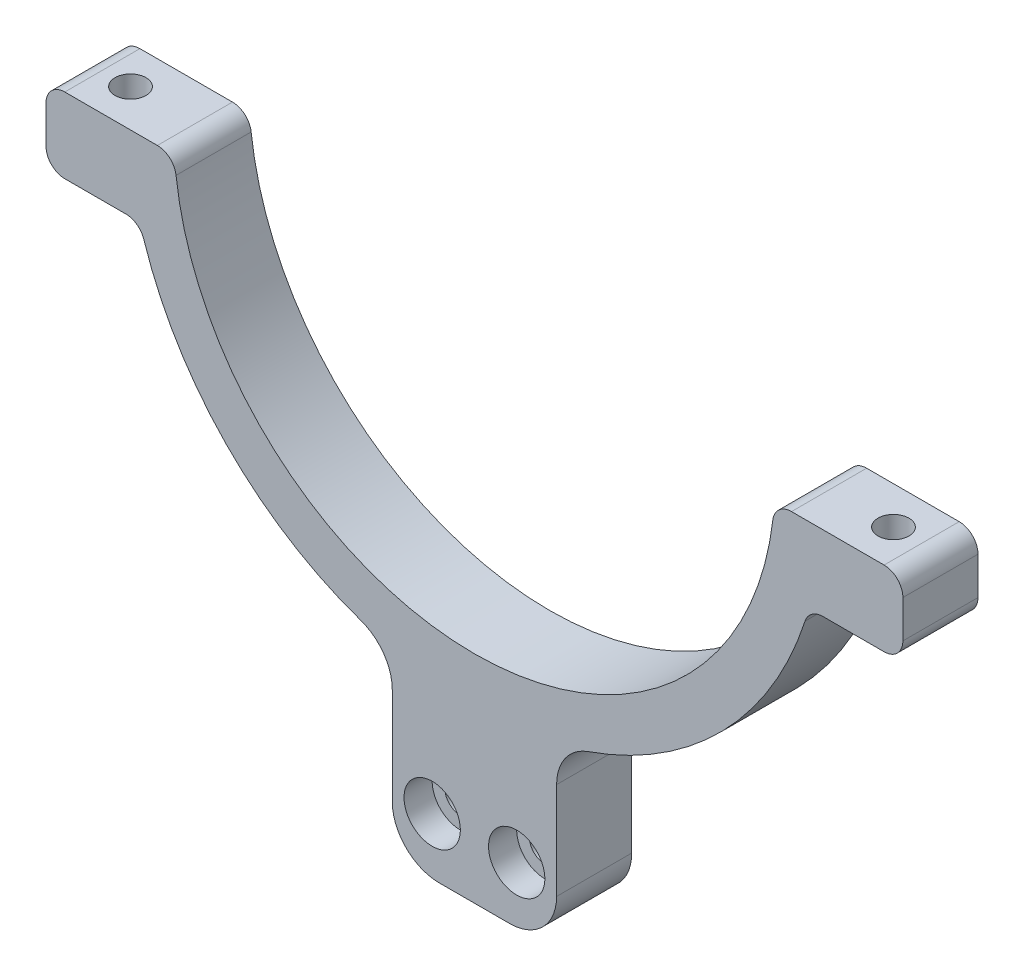
ISO-10303-21;
HEADER;
FILE_DESCRIPTION(('STEP AP214'),'2;1');
FILE_NAME('part.step','',(''),(''),'','','');
FILE_SCHEMA(('AUTOMOTIVE_DESIGN { 1 0 10303 214 1 1 1 1 }'));
ENDSEC;
DATA;
#1=APPLICATION_CONTEXT('core data for automotive mechanical design processes');
#2=APPLICATION_PROTOCOL_DEFINITION('international standard','automotive_design',2000,#1);
#3=PRODUCT_CONTEXT('',#1,'mechanical');
#4=PRODUCT('Part','Part','',(#3));
#5=PRODUCT_RELATED_PRODUCT_CATEGORY('part','',(#4));
#6=PRODUCT_DEFINITION_FORMATION('','',#4);
#7=PRODUCT_DEFINITION_CONTEXT('part definition',#1,'design');
#8=PRODUCT_DEFINITION('design','',#6,#7);
#9=PRODUCT_DEFINITION_SHAPE('','',#8);
#10=(LENGTH_UNIT() NAMED_UNIT(*) SI_UNIT(.MILLI.,.METRE.));
#11=(NAMED_UNIT(*) PLANE_ANGLE_UNIT() SI_UNIT($,.RADIAN.));
#12=(NAMED_UNIT(*) SI_UNIT($,.STERADIAN.) SOLID_ANGLE_UNIT());
#13=UNCERTAINTY_MEASURE_WITH_UNIT(LENGTH_MEASURE(1.E-05),#10,'distance_accuracy_value','');
#14=(GEOMETRIC_REPRESENTATION_CONTEXT(3) GLOBAL_UNCERTAINTY_ASSIGNED_CONTEXT((#13)) GLOBAL_UNIT_ASSIGNED_CONTEXT((#10,
#11,#12)) REPRESENTATION_CONTEXT('',''));
#15=CARTESIAN_POINT('',(0.,0.,0.));
#16=DIRECTION('',(0.,0.,1.));
#17=DIRECTION('',(1.,0.,0.));
#18=AXIS2_PLACEMENT_3D('',#15,#16,#17);
#19=CARTESIAN_POINT('',(-4.5,-49.,0.));
#20=DIRECTION('',(0.,0.,1.));
#21=DIRECTION('',(1.,0.,0.));
#22=AXIS2_PLACEMENT_3D('',#19,#20,#21);
#23=CYLINDRICAL_SURFACE('',#22,1.65);
#24=CARTESIAN_POINT('',(-4.5,-49.,0.));
#25=DIRECTION('',(0.,0.,1.));
#26=DIRECTION('',(1.,0.,0.));
#27=AXIS2_PLACEMENT_3D('',#24,#25,#26);
#28=CIRCLE('',#27,1.65);
#29=CARTESIAN_POINT('',(-2.85,-49.,0.));
#30=VERTEX_POINT('',#29);
#31=EDGE_CURVE('E402',#30,#30,#28,.T.);
#32=ORIENTED_EDGE('',*,*,#31,.F.);
#33=EDGE_LOOP('',(#32));
#34=FACE_BOUND('',#33,.T.);
#35=CARTESIAN_POINT('',(-4.5,-49.,5.));
#36=DIRECTION('',(0.,0.,1.));
#37=DIRECTION('',(1.,0.,0.));
#38=AXIS2_PLACEMENT_3D('',#35,#36,#37);
#39=CIRCLE('',#38,1.65);
#40=CARTESIAN_POINT('',(-2.85,-49.,5.));
#41=VERTEX_POINT('',#40);
#42=EDGE_CURVE('E52',#41,#41,#39,.F.);
#43=ORIENTED_EDGE('',*,*,#42,.F.);
#44=EDGE_LOOP('',(#43));
#45=FACE_BOUND('',#44,.T.);
#46=ADVANCED_FACE('F48',(#34,#45),#23,.F.);
#47=CARTESIAN_POINT('',(4.5,-49.,0.));
#48=DIRECTION('',(0.,0.,1.));
#49=DIRECTION('',(1.,0.,0.));
#50=AXIS2_PLACEMENT_3D('',#47,#48,#49);
#51=CYLINDRICAL_SURFACE('',#50,1.65);
#52=CARTESIAN_POINT('',(4.5,-49.,0.));
#53=DIRECTION('',(0.,0.,1.));
#54=DIRECTION('',(1.,0.,0.));
#55=AXIS2_PLACEMENT_3D('',#52,#53,#54);
#56=CIRCLE('',#55,1.65);
#57=CARTESIAN_POINT('',(6.15,-49.,0.));
#58=VERTEX_POINT('',#57);
#59=EDGE_CURVE('E409',#58,#58,#56,.T.);
#60=ORIENTED_EDGE('',*,*,#59,.F.);
#61=EDGE_LOOP('',(#60));
#62=FACE_BOUND('',#61,.T.);
#63=CARTESIAN_POINT('',(4.5,-49.,5.));
#64=DIRECTION('',(0.,0.,1.));
#65=DIRECTION('',(1.,0.,0.));
#66=AXIS2_PLACEMENT_3D('',#63,#64,#65);
#67=CIRCLE('',#66,1.65);
#68=CARTESIAN_POINT('',(6.15,-49.,5.));
#69=VERTEX_POINT('',#68);
#70=EDGE_CURVE('E379',#69,#69,#67,.F.);
#71=ORIENTED_EDGE('',*,*,#70,.F.);
#72=EDGE_LOOP('',(#71));
#73=FACE_BOUND('',#72,.T.);
#74=ADVANCED_FACE('F492',(#62,#73),#51,.F.);
#75=CARTESIAN_POINT('',(-40.6230262611138,-1.99999999999997,4.));
#76=DIRECTION('',(0.,-1.,0.));
#77=DIRECTION('',(1.,0.,0.));
#78=AXIS2_PLACEMENT_3D('',#75,#76,#77);
#79=CYLINDRICAL_SURFACE('',#78,1.65);
#80=CARTESIAN_POINT('',(-40.6230262611138,-1.99999999999997,4.));
#81=DIRECTION('',(0.,1.,0.));
#82=DIRECTION('',(-1.,0.,0.));
#83=AXIS2_PLACEMENT_3D('',#80,#81,#82);
#84=CIRCLE('',#83,1.65);
#85=CARTESIAN_POINT('',(-42.2730262611137,-1.99999999999997,4.));
#86=VERTEX_POINT('',#85);
#87=EDGE_CURVE('E278',#86,#86,#84,.T.);
#88=ORIENTED_EDGE('',*,*,#87,.T.);
#89=EDGE_LOOP('',(#88));
#90=FACE_BOUND('',#89,.T.);
#91=CARTESIAN_POINT('',(-40.6230262611138,-7.,4.));
#92=DIRECTION('',(0.,-1.,0.));
#93=DIRECTION('',(1.,0.,0.));
#94=AXIS2_PLACEMENT_3D('',#91,#92,#93);
#95=CIRCLE('',#94,1.65);
#96=CARTESIAN_POINT('',(-38.9730262611138,-7.,4.));
#97=VERTEX_POINT('',#96);
#98=EDGE_CURVE('E276',#97,#97,#95,.T.);
#99=ORIENTED_EDGE('',*,*,#98,.T.);
#100=EDGE_LOOP('',(#99));
#101=FACE_BOUND('',#100,.T.);
#102=ADVANCED_FACE('F498',(#90,#101),#79,.F.);
#103=CARTESIAN_POINT('',(40.6230262611138,-1.99999999999998,4.));
#104=DIRECTION('',(0.,-1.,0.));
#105=DIRECTION('',(1.,0.,0.));
#106=AXIS2_PLACEMENT_3D('',#103,#104,#105);
#107=CYLINDRICAL_SURFACE('',#106,1.65);
#108=CARTESIAN_POINT('',(40.6230262611138,-1.99999999999998,4.));
#109=DIRECTION('',(0.,-1.,0.));
#110=DIRECTION('',(1.,0.,0.));
#111=AXIS2_PLACEMENT_3D('',#108,#109,#110);
#112=CIRCLE('',#111,1.65);
#113=CARTESIAN_POINT('',(42.2730262611137,-1.99999999999998,4.));
#114=VERTEX_POINT('',#113);
#115=EDGE_CURVE('E274',#114,#114,#112,.T.);
#116=ORIENTED_EDGE('',*,*,#115,.F.);
#117=EDGE_LOOP('',(#116));
#118=FACE_BOUND('',#117,.T.);
#119=CARTESIAN_POINT('',(40.6230262611138,-7.,4.));
#120=DIRECTION('',(0.,-1.,0.));
#121=DIRECTION('',(1.,0.,0.));
#122=AXIS2_PLACEMENT_3D('',#119,#120,#121);
#123=CIRCLE('',#122,1.65);
#124=CARTESIAN_POINT('',(42.2730262611137,-7.,4.));
#125=VERTEX_POINT('',#124);
#126=EDGE_CURVE('E271',#125,#125,#123,.F.);
#127=ORIENTED_EDGE('',*,*,#126,.F.);
#128=EDGE_LOOP('',(#127));
#129=FACE_BOUND('',#128,.T.);
#130=ADVANCED_FACE('F604',(#118,#129),#107,.F.);
#131=CARTESIAN_POINT('',(0.,0.,8.));
#132=DIRECTION('',(0.,0.,-1.));
#133=DIRECTION('',(-1.,0.,0.));
#134=AXIS2_PLACEMENT_3D('',#131,#132,#133);
#135=PLANE('',#134);
#136=CARTESIAN_POINT('',(4.5,-49.,8.));
#137=DIRECTION('',(0.,0.,1.));
#138=DIRECTION('',(1.,0.,0.));
#139=AXIS2_PLACEMENT_3D('',#136,#137,#138);
#140=CIRCLE('',#139,3.);
#141=CARTESIAN_POINT('',(7.5,-49.,8.));
#142=VERTEX_POINT('',#141);
#143=EDGE_CURVE('E387',#142,#142,#140,.T.);
#144=ORIENTED_EDGE('',*,*,#143,.F.);
#145=EDGE_LOOP('',(#144));
#146=FACE_BOUND('',#145,.T.);
#147=CARTESIAN_POINT('',(-4.5,-49.,8.));
#148=DIRECTION('',(0.,0.,1.));
#149=DIRECTION('',(1.,0.,0.));
#150=AXIS2_PLACEMENT_3D('',#147,#148,#149);
#151=CIRCLE('',#150,3.);
#152=CARTESIAN_POINT('',(-1.5,-49.,8.));
#153=VERTEX_POINT('',#152);
#154=EDGE_CURVE('E392',#153,#153,#151,.T.);
#155=ORIENTED_EDGE('',*,*,#154,.F.);
#156=EDGE_LOOP('',(#155));
#157=FACE_BOUND('',#156,.T.);
#158=DIRECTION('',(0.,1.,0.));
#159=VECTOR('',#158,1.);
#160=CARTESIAN_POINT('',(-8.75,-55.,8.));
#161=LINE('',#160,#159);
#162=CARTESIAN_POINT('',(-8.75,-50.,8.));
#163=VERTEX_POINT('',#162);
#164=CARTESIAN_POINT('',(-8.75,-39.6854822321715,8.));
#165=VERTEX_POINT('',#164);
#166=EDGE_CURVE('E403',#163,#165,#161,.T.);
#167=ORIENTED_EDGE('',*,*,#166,.F.);
#168=CARTESIAN_POINT('',(-3.75,-50.,8.));
#169=DIRECTION('',(0.,0.,-1.));
#170=DIRECTION('',(-1.,0.,0.));
#171=AXIS2_PLACEMENT_3D('',#168,#169,#170);
#172=CIRCLE('',#171,5.);
#173=CARTESIAN_POINT('',(-3.75,-55.,8.));
#174=VERTEX_POINT('',#173);
#175=EDGE_CURVE('E357',#163,#174,#172,.F.);
#176=ORIENTED_EDGE('',*,*,#175,.T.);
#177=DIRECTION('',(-1.,0.,0.));
#178=VECTOR('',#177,1.);
#179=CARTESIAN_POINT('',(-11.,-55.,8.));
#180=LINE('',#179,#178);
#181=CARTESIAN_POINT('',(3.75,-55.,8.));
#182=VERTEX_POINT('',#181);
#183=EDGE_CURVE('E412',#182,#174,#180,.T.);
#184=ORIENTED_EDGE('',*,*,#183,.F.);
#185=CARTESIAN_POINT('',(3.75,-50.,8.));
#186=DIRECTION('',(0.,0.,-1.));
#187=DIRECTION('',(-1.,0.,0.));
#188=AXIS2_PLACEMENT_3D('',#185,#186,#187);
#189=CIRCLE('',#188,5.);
#190=CARTESIAN_POINT('',(8.75,-50.,8.));
#191=VERTEX_POINT('',#190);
#192=EDGE_CURVE('E355',#182,#191,#189,.F.);
#193=ORIENTED_EDGE('',*,*,#192,.T.);
#194=DIRECTION('',(0.,-1.,0.));
#195=VECTOR('',#194,1.);
#196=CARTESIAN_POINT('',(8.75,-55.,8.));
#197=LINE('',#196,#195);
#198=CARTESIAN_POINT('',(8.75,-39.6854822321715,8.));
#199=VERTEX_POINT('',#198);
#200=EDGE_CURVE('E406',#199,#191,#197,.T.);
#201=ORIENTED_EDGE('',*,*,#200,.F.);
#202=CARTESIAN_POINT('',(13.75,-39.6854822321715,8.));
#203=DIRECTION('',(0.,0.,-1.));
#204=DIRECTION('',(-1.,0.,0.));
#205=AXIS2_PLACEMENT_3D('',#202,#203,#204);
#206=CIRCLE('',#205,5.);
#207=CARTESIAN_POINT('',(12.1130952380952,-34.9610200616749,8.));
#208=VERTEX_POINT('',#207);
#209=EDGE_CURVE('E376',#199,#208,#206,.T.);
#210=ORIENTED_EDGE('',*,*,#209,.T.);
#211=CARTESIAN_POINT('',(0.,0.,8.));
#212=DIRECTION('',(0.,0.,1.));
#213=DIRECTION('',(1.,0.,0.));
#214=AXIS2_PLACEMENT_3D('',#211,#212,#213);
#215=CIRCLE('',#214,37.);
#216=CARTESIAN_POINT('',(35.2049788033508,-11.3846153846154,8.));
#217=VERTEX_POINT('',#216);
#218=EDGE_CURVE('E439',#208,#217,#215,.T.);
#219=ORIENTED_EDGE('',*,*,#218,.T.);
#220=CARTESIAN_POINT('',(37.1079506305589,-12.,8.));
#221=DIRECTION('',(0.,0.,-1.));
#222=DIRECTION('',(-1.,0.,0.));
#223=AXIS2_PLACEMENT_3D('',#220,#221,#222);
#224=CIRCLE('',#223,2.);
#225=CARTESIAN_POINT('',(37.1079506305589,-10.,8.));
#226=VERTEX_POINT('',#225);
#227=EDGE_CURVE('E348',#217,#226,#224,.T.);
#228=ORIENTED_EDGE('',*,*,#227,.T.);
#229=DIRECTION('',(1.,0.,0.));
#230=VECTOR('',#229,1.);
#231=CARTESIAN_POINT('',(35.6230262611138,-10.,8.));
#232=LINE('',#231,#230);
#233=CARTESIAN_POINT('',(43.6230262611138,-10.,8.));
#234=VERTEX_POINT('',#233);
#235=EDGE_CURVE('E441',#226,#234,#232,.T.);
#236=ORIENTED_EDGE('',*,*,#235,.T.);
#237=CARTESIAN_POINT('',(43.6230262611138,-8.,8.));
#238=DIRECTION('',(0.,0.,-1.));
#239=DIRECTION('',(-1.,0.,0.));
#240=AXIS2_PLACEMENT_3D('',#237,#238,#239);
#241=CIRCLE('',#240,2.);
#242=CARTESIAN_POINT('',(45.6230262611138,-8.,8.));
#243=VERTEX_POINT('',#242);
#244=EDGE_CURVE('E310',#234,#243,#241,.F.);
#245=ORIENTED_EDGE('',*,*,#244,.T.);
#246=DIRECTION('',(0.,1.,0.));
#247=VECTOR('',#246,1.);
#248=CARTESIAN_POINT('',(45.6230262611138,-10.,8.));
#249=LINE('',#248,#247);
#250=CARTESIAN_POINT('',(45.6230262611138,-4.,8.));
#251=VERTEX_POINT('',#250);
#252=EDGE_CURVE('E444',#243,#251,#249,.T.);
#253=ORIENTED_EDGE('',*,*,#252,.T.);
#254=CARTESIAN_POINT('',(43.6230262611138,-4.,8.));
#255=DIRECTION('',(0.,0.,-1.));
#256=DIRECTION('',(-1.,0.,0.));
#257=AXIS2_PLACEMENT_3D('',#254,#255,#256);
#258=CIRCLE('',#257,2.);
#259=CARTESIAN_POINT('',(43.6230262611138,-2.,8.));
#260=VERTEX_POINT('',#259);
#261=EDGE_CURVE('E312',#251,#260,#258,.F.);
#262=ORIENTED_EDGE('',*,*,#261,.T.);
#263=DIRECTION('',(-1.,0.,0.));
#264=VECTOR('',#263,1.);
#265=CARTESIAN_POINT('',(31.9374388453426,-2.,8.));
#266=LINE('',#265,#264);
#267=CARTESIAN_POINT('',(33.7638860322683,-2.,8.));
#268=VERTEX_POINT('',#267);
#269=EDGE_CURVE('E447',#260,#268,#266,.T.);
#270=ORIENTED_EDGE('',*,*,#269,.T.);
#271=CARTESIAN_POINT('',(33.7638860322683,-4.,8.));
#272=DIRECTION('',(0.,0.,-1.));
#273=DIRECTION('',(-1.,0.,0.));
#274=AXIS2_PLACEMENT_3D('',#271,#272,#273);
#275=CIRCLE('',#274,2.);
#276=CARTESIAN_POINT('',(31.7777750891937,-3.76470588235294,8.));
#277=VERTEX_POINT('',#276);
#278=EDGE_CURVE('E314',#268,#277,#275,.F.);
#279=ORIENTED_EDGE('',*,*,#278,.T.);
#280=CARTESIAN_POINT('',(0.,0.,8.));
#281=DIRECTION('',(0.,0.,-1.));
#282=DIRECTION('',(-1.,0.,0.));
#283=AXIS2_PLACEMENT_3D('',#280,#281,#282);
#284=CIRCLE('',#283,32.);
#285=CARTESIAN_POINT('',(-31.7777750891937,-3.76470588235294,8.));
#286=VERTEX_POINT('',#285);
#287=EDGE_CURVE('E450',#277,#286,#284,.T.);
#288=ORIENTED_EDGE('',*,*,#287,.T.);
#289=CARTESIAN_POINT('',(-33.7638860322683,-4.,8.));
#290=DIRECTION('',(0.,0.,-1.));
#291=DIRECTION('',(-1.,0.,0.));
#292=AXIS2_PLACEMENT_3D('',#289,#290,#291);
#293=CIRCLE('',#292,2.);
#294=CARTESIAN_POINT('',(-33.7638860322683,-2.,8.));
#295=VERTEX_POINT('',#294);
#296=EDGE_CURVE('E316',#286,#295,#293,.F.);
#297=ORIENTED_EDGE('',*,*,#296,.T.);
#298=DIRECTION('',(-1.,0.,0.));
#299=VECTOR('',#298,1.);
#300=CARTESIAN_POINT('',(-31.9374388453426,-2.,8.));
#301=LINE('',#300,#299);
#302=CARTESIAN_POINT('',(-43.6230262611138,-2.,8.));
#303=VERTEX_POINT('',#302);
#304=EDGE_CURVE('E240',#295,#303,#301,.T.);
#305=ORIENTED_EDGE('',*,*,#304,.T.);
#306=CARTESIAN_POINT('',(-43.6230262611138,-4.,8.));
#307=DIRECTION('',(0.,0.,-1.));
#308=DIRECTION('',(-1.,0.,0.));
#309=AXIS2_PLACEMENT_3D('',#306,#307,#308);
#310=CIRCLE('',#309,2.);
#311=CARTESIAN_POINT('',(-45.6230262611138,-4.,8.));
#312=VERTEX_POINT('',#311);
#313=EDGE_CURVE('E318',#303,#312,#310,.F.);
#314=ORIENTED_EDGE('',*,*,#313,.T.);
#315=DIRECTION('',(0.,-1.,0.));
#316=VECTOR('',#315,1.);
#317=CARTESIAN_POINT('',(-45.6230262611138,-10.,8.));
#318=LINE('',#317,#316);
#319=CARTESIAN_POINT('',(-45.6230262611138,-8.,8.));
#320=VERTEX_POINT('',#319);
#321=EDGE_CURVE('E270',#312,#320,#318,.T.);
#322=ORIENTED_EDGE('',*,*,#321,.T.);
#323=CARTESIAN_POINT('',(-43.6230262611138,-8.,8.));
#324=DIRECTION('',(0.,0.,-1.));
#325=DIRECTION('',(-1.,0.,0.));
#326=AXIS2_PLACEMENT_3D('',#323,#324,#325);
#327=CIRCLE('',#326,2.);
#328=CARTESIAN_POINT('',(-43.6230262611138,-10.,8.));
#329=VERTEX_POINT('',#328);
#330=EDGE_CURVE('E308',#320,#329,#327,.F.);
#331=ORIENTED_EDGE('',*,*,#330,.T.);
#332=DIRECTION('',(1.,0.,0.));
#333=VECTOR('',#332,1.);
#334=CARTESIAN_POINT('',(-35.6230262611138,-10.,8.));
#335=LINE('',#334,#333);
#336=CARTESIAN_POINT('',(-37.1079506305589,-10.,8.));
#337=VERTEX_POINT('',#336);
#338=EDGE_CURVE('E435',#329,#337,#335,.T.);
#339=ORIENTED_EDGE('',*,*,#338,.T.);
#340=CARTESIAN_POINT('',(-37.1079506305589,-12.,8.));
#341=DIRECTION('',(0.,0.,-1.));
#342=DIRECTION('',(-1.,0.,0.));
#343=AXIS2_PLACEMENT_3D('',#340,#341,#342);
#344=CIRCLE('',#343,2.);
#345=CARTESIAN_POINT('',(-35.2049788033508,-11.3846153846154,8.));
#346=VERTEX_POINT('',#345);
#347=EDGE_CURVE('E227',#337,#346,#344,.T.);
#348=ORIENTED_EDGE('',*,*,#347,.T.);
#349=CARTESIAN_POINT('',(0.,0.,8.));
#350=DIRECTION('',(0.,0.,1.));
#351=DIRECTION('',(-1.,0.,0.));
#352=AXIS2_PLACEMENT_3D('',#349,#350,#351);
#353=CIRCLE('',#352,37.);
#354=CARTESIAN_POINT('',(-12.1130952380952,-34.9610200616749,8.));
#355=VERTEX_POINT('',#354);
#356=EDGE_CURVE('E238',#346,#355,#353,.T.);
#357=ORIENTED_EDGE('',*,*,#356,.T.);
#358=CARTESIAN_POINT('',(-13.75,-39.6854822321715,8.));
#359=DIRECTION('',(0.,0.,-1.));
#360=DIRECTION('',(-1.,0.,0.));
#361=AXIS2_PLACEMENT_3D('',#358,#359,#360);
#362=CIRCLE('',#361,5.);
#363=EDGE_CURVE('E57',#355,#165,#362,.T.);
#364=ORIENTED_EDGE('',*,*,#363,.T.);
#365=EDGE_LOOP('',(#167,#176,#184,#193,#201,#210,#219,#228,#236,#245,#253,#262,#270,#279,#288,
#297,#305,#314,#322,#331,#339,#348,#357,#364));
#366=FACE_BOUND('',#365,.T.);
#367=ADVANCED_FACE('F469',(#146,#157,#366),#135,.F.);
#368=CARTESIAN_POINT('',(0.,0.,0.));
#369=DIRECTION('',(0.,0.,-1.));
#370=DIRECTION('',(-1.,0.,0.));
#371=AXIS2_PLACEMENT_3D('',#368,#369,#370);
#372=PLANE('',#371);
#373=DIRECTION('',(-1.,0.,0.));
#374=VECTOR('',#373,1.);
#375=CARTESIAN_POINT('',(-11.,-55.,0.));
#376=LINE('',#375,#374);
#377=CARTESIAN_POINT('',(3.75,-55.,0.));
#378=VERTEX_POINT('',#377);
#379=CARTESIAN_POINT('',(-3.75,-55.,0.));
#380=VERTEX_POINT('',#379);
#381=EDGE_CURVE('E415',#378,#380,#376,.T.);
#382=ORIENTED_EDGE('',*,*,#381,.T.);
#383=CARTESIAN_POINT('',(-3.75,-50.,0.));
#384=DIRECTION('',(0.,0.,-1.));
#385=DIRECTION('',(-1.,0.,0.));
#386=AXIS2_PLACEMENT_3D('',#383,#384,#385);
#387=CIRCLE('',#386,5.);
#388=CARTESIAN_POINT('',(-8.75,-50.,0.));
#389=VERTEX_POINT('',#388);
#390=EDGE_CURVE('E366',#380,#389,#387,.T.);
#391=ORIENTED_EDGE('',*,*,#390,.T.);
#392=DIRECTION('',(0.,1.,0.));
#393=VECTOR('',#392,1.);
#394=CARTESIAN_POINT('',(-8.75,-55.,0.));
#395=LINE('',#394,#393);
#396=CARTESIAN_POINT('',(-8.75,-39.6854822321715,0.));
#397=VERTEX_POINT('',#396);
#398=EDGE_CURVE('E400',#389,#397,#395,.T.);
#399=ORIENTED_EDGE('',*,*,#398,.T.);
#400=CARTESIAN_POINT('',(-13.75,-39.6854822321715,0.));
#401=DIRECTION('',(0.,0.,-1.));
#402=DIRECTION('',(-1.,0.,0.));
#403=AXIS2_PLACEMENT_3D('',#400,#401,#402);
#404=CIRCLE('',#403,5.);
#405=CARTESIAN_POINT('',(-12.1130952380952,-34.9610200616749,0.));
#406=VERTEX_POINT('',#405);
#407=EDGE_CURVE('E12',#397,#406,#404,.F.);
#408=ORIENTED_EDGE('',*,*,#407,.T.);
#409=CARTESIAN_POINT('',(0.,0.,0.));
#410=DIRECTION('',(0.,0.,1.));
#411=DIRECTION('',(-1.,0.,0.));
#412=AXIS2_PLACEMENT_3D('',#409,#410,#411);
#413=CIRCLE('',#412,37.);
#414=CARTESIAN_POINT('',(-35.2049788033508,-11.3846153846154,0.));
#415=VERTEX_POINT('',#414);
#416=EDGE_CURVE('E235',#415,#406,#413,.T.);
#417=ORIENTED_EDGE('',*,*,#416,.F.);
#418=CARTESIAN_POINT('',(-37.1079506305589,-12.,0.));
#419=DIRECTION('',(0.,0.,-1.));
#420=DIRECTION('',(-1.,0.,0.));
#421=AXIS2_PLACEMENT_3D('',#418,#419,#420);
#422=CIRCLE('',#421,2.);
#423=CARTESIAN_POINT('',(-37.1079506305589,-10.,0.));
#424=VERTEX_POINT('',#423);
#425=EDGE_CURVE('E218',#415,#424,#422,.F.);
#426=ORIENTED_EDGE('',*,*,#425,.T.);
#427=DIRECTION('',(1.,0.,0.));
#428=VECTOR('',#427,1.);
#429=CARTESIAN_POINT('',(-35.6230262611138,-10.,0.));
#430=LINE('',#429,#428);
#431=CARTESIAN_POINT('',(-43.6230262611138,-10.,0.));
#432=VERTEX_POINT('',#431);
#433=EDGE_CURVE('E248',#432,#424,#430,.T.);
#434=ORIENTED_EDGE('',*,*,#433,.F.);
#435=CARTESIAN_POINT('',(-43.6230262611138,-8.,0.));
#436=DIRECTION('',(0.,0.,-1.));
#437=DIRECTION('',(-1.,0.,0.));
#438=AXIS2_PLACEMENT_3D('',#435,#436,#437);
#439=CIRCLE('',#438,2.);
#440=CARTESIAN_POINT('',(-45.6230262611138,-8.,0.));
#441=VERTEX_POINT('',#440);
#442=EDGE_CURVE('E291',#432,#441,#439,.T.);
#443=ORIENTED_EDGE('',*,*,#442,.T.);
#444=DIRECTION('',(0.,-1.,0.));
#445=VECTOR('',#444,1.);
#446=CARTESIAN_POINT('',(-45.6230262611138,-10.,0.));
#447=LINE('',#446,#445);
#448=CARTESIAN_POINT('',(-45.6230262611138,-4.,0.));
#449=VERTEX_POINT('',#448);
#450=EDGE_CURVE('E252',#449,#441,#447,.T.);
#451=ORIENTED_EDGE('',*,*,#450,.F.);
#452=CARTESIAN_POINT('',(-43.6230262611138,-4.,0.));
#453=DIRECTION('',(0.,0.,-1.));
#454=DIRECTION('',(-1.,0.,0.));
#455=AXIS2_PLACEMENT_3D('',#452,#453,#454);
#456=CIRCLE('',#455,2.);
#457=CARTESIAN_POINT('',(-43.6230262611138,-2.,0.));
#458=VERTEX_POINT('',#457);
#459=EDGE_CURVE('E301',#449,#458,#456,.T.);
#460=ORIENTED_EDGE('',*,*,#459,.T.);
#461=DIRECTION('',(-1.,0.,0.));
#462=VECTOR('',#461,1.);
#463=CARTESIAN_POINT('',(-31.9374388453426,-2.,0.));
#464=LINE('',#463,#462);
#465=CARTESIAN_POINT('',(-33.7638860322683,-2.,0.));
#466=VERTEX_POINT('',#465);
#467=EDGE_CURVE('E267',#466,#458,#464,.T.);
#468=ORIENTED_EDGE('',*,*,#467,.F.);
#469=CARTESIAN_POINT('',(-33.7638860322683,-4.,0.));
#470=DIRECTION('',(0.,0.,-1.));
#471=DIRECTION('',(-1.,0.,0.));
#472=AXIS2_PLACEMENT_3D('',#469,#470,#471);
#473=CIRCLE('',#472,2.);
#474=CARTESIAN_POINT('',(-31.7777750891937,-3.76470588235294,0.));
#475=VERTEX_POINT('',#474);
#476=EDGE_CURVE('E299',#466,#475,#473,.T.);
#477=ORIENTED_EDGE('',*,*,#476,.T.);
#478=CARTESIAN_POINT('',(0.,0.,0.));
#479=DIRECTION('',(0.,0.,-1.));
#480=DIRECTION('',(-1.,0.,0.));
#481=AXIS2_PLACEMENT_3D('',#478,#479,#480);
#482=CIRCLE('',#481,32.);
#483=CARTESIAN_POINT('',(31.7777750891937,-3.76470588235294,0.));
#484=VERTEX_POINT('',#483);
#485=EDGE_CURVE('E264',#484,#475,#482,.T.);
#486=ORIENTED_EDGE('',*,*,#485,.F.);
#487=CARTESIAN_POINT('',(33.7638860322683,-4.,0.));
#488=DIRECTION('',(0.,0.,-1.));
#489=DIRECTION('',(-1.,0.,0.));
#490=AXIS2_PLACEMENT_3D('',#487,#488,#489);
#491=CIRCLE('',#490,2.);
#492=CARTESIAN_POINT('',(33.7638860322683,-2.,0.));
#493=VERTEX_POINT('',#492);
#494=EDGE_CURVE('E297',#484,#493,#491,.T.);
#495=ORIENTED_EDGE('',*,*,#494,.T.);
#496=DIRECTION('',(-1.,0.,0.));
#497=VECTOR('',#496,1.);
#498=CARTESIAN_POINT('',(31.9374388453426,-2.,0.));
#499=LINE('',#498,#497);
#500=CARTESIAN_POINT('',(43.6230262611138,-2.,0.));
#501=VERTEX_POINT('',#500);
#502=EDGE_CURVE('E261',#501,#493,#499,.T.);
#503=ORIENTED_EDGE('',*,*,#502,.F.);
#504=CARTESIAN_POINT('',(43.6230262611138,-4.,0.));
#505=DIRECTION('',(0.,0.,-1.));
#506=DIRECTION('',(-1.,0.,0.));
#507=AXIS2_PLACEMENT_3D('',#504,#505,#506);
#508=CIRCLE('',#507,2.);
#509=CARTESIAN_POINT('',(45.6230262611138,-4.,0.));
#510=VERTEX_POINT('',#509);
#511=EDGE_CURVE('E295',#501,#510,#508,.T.);
#512=ORIENTED_EDGE('',*,*,#511,.T.);
#513=DIRECTION('',(0.,1.,0.));
#514=VECTOR('',#513,1.);
#515=CARTESIAN_POINT('',(45.6230262611138,-10.,0.));
#516=LINE('',#515,#514);
#517=CARTESIAN_POINT('',(45.6230262611138,-8.,0.));
#518=VERTEX_POINT('',#517);
#519=EDGE_CURVE('E258',#518,#510,#516,.T.);
#520=ORIENTED_EDGE('',*,*,#519,.F.);
#521=CARTESIAN_POINT('',(43.6230262611138,-8.,0.));
#522=DIRECTION('',(0.,0.,-1.));
#523=DIRECTION('',(-1.,0.,0.));
#524=AXIS2_PLACEMENT_3D('',#521,#522,#523);
#525=CIRCLE('',#524,2.);
#526=CARTESIAN_POINT('',(43.6230262611138,-10.,0.));
#527=VERTEX_POINT('',#526);
#528=EDGE_CURVE('E293',#518,#527,#525,.T.);
#529=ORIENTED_EDGE('',*,*,#528,.T.);
#530=DIRECTION('',(1.,0.,0.));
#531=VECTOR('',#530,1.);
#532=CARTESIAN_POINT('',(35.6230262611138,-10.,0.));
#533=LINE('',#532,#531);
#534=CARTESIAN_POINT('',(37.1079506305589,-10.,0.));
#535=VERTEX_POINT('',#534);
#536=EDGE_CURVE('E250',#535,#527,#533,.T.);
#537=ORIENTED_EDGE('',*,*,#536,.F.);
#538=CARTESIAN_POINT('',(37.1079506305589,-12.,0.));
#539=DIRECTION('',(0.,0.,-1.));
#540=DIRECTION('',(-1.,0.,0.));
#541=AXIS2_PLACEMENT_3D('',#538,#539,#540);
#542=CIRCLE('',#541,2.);
#543=CARTESIAN_POINT('',(35.2049788033508,-11.3846153846154,0.));
#544=VERTEX_POINT('',#543);
#545=EDGE_CURVE('E345',#535,#544,#542,.F.);
#546=ORIENTED_EDGE('',*,*,#545,.T.);
#547=CARTESIAN_POINT('',(0.,0.,0.));
#548=DIRECTION('',(0.,0.,1.));
#549=DIRECTION('',(1.,0.,0.));
#550=AXIS2_PLACEMENT_3D('',#547,#548,#549);
#551=CIRCLE('',#550,37.);
#552=CARTESIAN_POINT('',(12.1130952380952,-34.9610200616749,0.));
#553=VERTEX_POINT('',#552);
#554=EDGE_CURVE('E247',#553,#544,#551,.T.);
#555=ORIENTED_EDGE('',*,*,#554,.F.);
#556=CARTESIAN_POINT('',(13.75,-39.6854822321715,0.));
#557=DIRECTION('',(0.,0.,-1.));
#558=DIRECTION('',(-1.,0.,0.));
#559=AXIS2_PLACEMENT_3D('',#556,#557,#558);
#560=CIRCLE('',#559,5.);
#561=CARTESIAN_POINT('',(8.75,-39.6854822321715,0.));
#562=VERTEX_POINT('',#561);
#563=EDGE_CURVE('E72',#553,#562,#560,.F.);
#564=ORIENTED_EDGE('',*,*,#563,.T.);
#565=DIRECTION('',(0.,-1.,0.));
#566=VECTOR('',#565,1.);
#567=CARTESIAN_POINT('',(8.75,-55.,0.));
#568=LINE('',#567,#566);
#569=CARTESIAN_POINT('',(8.75,-50.,0.));
#570=VERTEX_POINT('',#569);
#571=EDGE_CURVE('E385',#562,#570,#568,.T.);
#572=ORIENTED_EDGE('',*,*,#571,.T.);
#573=CARTESIAN_POINT('',(3.75,-50.,0.));
#574=DIRECTION('',(0.,0.,-1.));
#575=DIRECTION('',(-1.,0.,0.));
#576=AXIS2_PLACEMENT_3D('',#573,#574,#575);
#577=CIRCLE('',#576,5.);
#578=EDGE_CURVE('E364',#570,#378,#577,.T.);
#579=ORIENTED_EDGE('',*,*,#578,.T.);
#580=EDGE_LOOP('',(#382,#391,#399,#408,#417,#426,#434,#443,#451,#460,#468,#477,#486,#495,#503,
#512,#520,#529,#537,#546,#555,#564,#572,#579));
#581=FACE_BOUND('',#580,.T.);
#582=ORIENTED_EDGE('',*,*,#59,.T.);
#583=EDGE_LOOP('',(#582));
#584=FACE_BOUND('',#583,.T.);
#585=ORIENTED_EDGE('',*,*,#31,.T.);
#586=EDGE_LOOP('',(#585));
#587=FACE_BOUND('',#586,.T.);
#588=ADVANCED_FACE('F243',(#581,#584,#587),#372,.T.);
#589=CARTESIAN_POINT('',(-45.6230262611138,-10.,8.));
#590=DIRECTION('',(1.,0.,0.));
#591=DIRECTION('',(0.,0.,-1.));
#592=AXIS2_PLACEMENT_3D('',#589,#590,#591);
#593=PLANE('',#592);
#594=ORIENTED_EDGE('',*,*,#321,.F.);
#595=DIRECTION('',(0.,0.,-1.));
#596=VECTOR('',#595,1.);
#597=CARTESIAN_POINT('',(-45.6230262611138,-4.,8.));
#598=LINE('',#597,#596);
#599=EDGE_CURVE('E288',#312,#449,#598,.T.);
#600=ORIENTED_EDGE('',*,*,#599,.T.);
#601=ORIENTED_EDGE('',*,*,#450,.T.);
#602=DIRECTION('',(0.,0.,-1.));
#603=VECTOR('',#602,1.);
#604=CARTESIAN_POINT('',(-45.6230262611138,-8.,8.));
#605=LINE('',#604,#603);
#606=EDGE_CURVE('E286',#441,#320,#605,.F.);
#607=ORIENTED_EDGE('',*,*,#606,.T.);
#608=EDGE_LOOP('',(#594,#600,#601,#607));
#609=FACE_BOUND('',#608,.T.);
#610=ADVANCED_FACE('F459',(#609),#593,.F.);
#611=CARTESIAN_POINT('',(-35.6230262611138,-10.,8.));
#612=DIRECTION('',(0.,1.,0.));
#613=DIRECTION('',(-1.,0.,0.));
#614=AXIS2_PLACEMENT_3D('',#611,#612,#613);
#615=PLANE('',#614);
#616=ORIENTED_EDGE('',*,*,#433,.T.);
#617=DIRECTION('',(0.,0.,1.));
#618=VECTOR('',#617,1.);
#619=CARTESIAN_POINT('',(-37.1079506305589,-10.,8.));
#620=LINE('',#619,#618);
#621=EDGE_CURVE('E223',#424,#337,#620,.T.);
#622=ORIENTED_EDGE('',*,*,#621,.T.);
#623=ORIENTED_EDGE('',*,*,#338,.F.);
#624=DIRECTION('',(0.,0.,-1.));
#625=VECTOR('',#624,1.);
#626=CARTESIAN_POINT('',(-43.6230262611138,-10.,8.));
#627=LINE('',#626,#625);
#628=CARTESIAN_POINT('',(-43.6230262611138,-10.,4.));
#629=VERTEX_POINT('',#628);
#630=EDGE_CURVE('E282',#329,#629,#627,.T.);
#631=ORIENTED_EDGE('',*,*,#630,.T.);
#632=CARTESIAN_POINT('',(-40.6230262611138,-10.,4.));
#633=DIRECTION('',(0.,1.,0.));
#634=DIRECTION('',(-1.,0.,0.));
#635=AXIS2_PLACEMENT_3D('',#632,#633,#634);
#636=CIRCLE('',#635,3.);
#637=EDGE_CURVE('E417',#629,#629,#636,.T.);
#638=ORIENTED_EDGE('',*,*,#637,.T.);
#639=DIRECTION('',(0.,0.,-1.));
#640=VECTOR('',#639,1.);
#641=CARTESIAN_POINT('',(-43.6230262611138,-10.,8.));
#642=LINE('',#641,#640);
#643=EDGE_CURVE('E239',#629,#432,#642,.T.);
#644=ORIENTED_EDGE('',*,*,#643,.T.);
#645=EDGE_LOOP('',(#616,#622,#623,#631,#638,#644));
#646=FACE_BOUND('',#645,.T.);
#647=ADVANCED_FACE('F471',(#646),#615,.F.);
#648=CARTESIAN_POINT('',(0.,0.,8.));
#649=DIRECTION('',(0.,0.,-1.));
#650=DIRECTION('',(-1.,0.,0.));
#651=AXIS2_PLACEMENT_3D('',#648,#649,#650);
#652=CYLINDRICAL_SURFACE('',#651,37.);
#653=ORIENTED_EDGE('',*,*,#416,.T.);
#654=DIRECTION('',(0.,0.,-1.));
#655=VECTOR('',#654,1.);
#656=CARTESIAN_POINT('',(-12.1130952380952,-34.9610200616749,8.));
#657=LINE('',#656,#655);
#658=EDGE_CURVE('E374',#406,#355,#657,.F.);
#659=ORIENTED_EDGE('',*,*,#658,.T.);
#660=ORIENTED_EDGE('',*,*,#356,.F.);
#661=DIRECTION('',(0.,0.,-1.));
#662=VECTOR('',#661,1.);
#663=CARTESIAN_POINT('',(-35.2049788033508,-11.3846153846154,8.));
#664=LINE('',#663,#662);
#665=EDGE_CURVE('E222',#346,#415,#664,.T.);
#666=ORIENTED_EDGE('',*,*,#665,.T.);
#667=EDGE_LOOP('',(#653,#659,#660,#666));
#668=FACE_BOUND('',#667,.T.);
#669=ADVANCED_FACE('F233',(#668),#652,.T.);
#670=CARTESIAN_POINT('',(0.,0.,8.));
#671=DIRECTION('',(0.,0.,-1.));
#672=DIRECTION('',(-1.,0.,0.));
#673=AXIS2_PLACEMENT_3D('',#670,#671,#672);
#674=CYLINDRICAL_SURFACE('',#673,37.);
#675=ORIENTED_EDGE('',*,*,#218,.F.);
#676=DIRECTION('',(0.,0.,-1.));
#677=VECTOR('',#676,1.);
#678=CARTESIAN_POINT('',(12.1130952380952,-34.9610200616749,8.));
#679=LINE('',#678,#677);
#680=EDGE_CURVE('E372',#208,#553,#679,.T.);
#681=ORIENTED_EDGE('',*,*,#680,.T.);
#682=ORIENTED_EDGE('',*,*,#554,.T.);
#683=DIRECTION('',(0.,0.,-1.));
#684=VECTOR('',#683,1.);
#685=CARTESIAN_POINT('',(35.2049788033508,-11.3846153846154,8.));
#686=LINE('',#685,#684);
#687=EDGE_CURVE('E228',#544,#217,#686,.F.);
#688=ORIENTED_EDGE('',*,*,#687,.T.);
#689=EDGE_LOOP('',(#675,#681,#682,#688));
#690=FACE_BOUND('',#689,.T.);
#691=ADVANCED_FACE('F576',(#690),#674,.T.);
#692=CARTESIAN_POINT('',(35.6230262611138,-10.,8.));
#693=DIRECTION('',(0.,1.,0.));
#694=DIRECTION('',(-1.,0.,0.));
#695=AXIS2_PLACEMENT_3D('',#692,#693,#694);
#696=PLANE('',#695);
#697=ORIENTED_EDGE('',*,*,#536,.T.);
#698=DIRECTION('',(0.,0.,-1.));
#699=VECTOR('',#698,1.);
#700=CARTESIAN_POINT('',(43.6230262611138,-10.,8.));
#701=LINE('',#700,#699);
#702=CARTESIAN_POINT('',(43.6230262611138,-10.,4.));
#703=VERTEX_POINT('',#702);
#704=EDGE_CURVE('E340',#527,#703,#701,.F.);
#705=ORIENTED_EDGE('',*,*,#704,.T.);
#706=CARTESIAN_POINT('',(40.6230262611138,-10.,4.));
#707=DIRECTION('',(0.,-1.,0.));
#708=DIRECTION('',(1.,0.,0.));
#709=AXIS2_PLACEMENT_3D('',#706,#707,#708);
#710=CIRCLE('',#709,3.);
#711=EDGE_CURVE('E426',#703,#703,#710,.T.);
#712=ORIENTED_EDGE('',*,*,#711,.F.);
#713=DIRECTION('',(0.,0.,-1.));
#714=VECTOR('',#713,1.);
#715=CARTESIAN_POINT('',(43.6230262611138,-10.,8.));
#716=LINE('',#715,#714);
#717=EDGE_CURVE('E338',#703,#234,#716,.F.);
#718=ORIENTED_EDGE('',*,*,#717,.T.);
#719=ORIENTED_EDGE('',*,*,#235,.F.);
#720=DIRECTION('',(0.,0.,1.));
#721=VECTOR('',#720,1.);
#722=CARTESIAN_POINT('',(37.1079506305589,-10.,0.));
#723=LINE('',#722,#721);
#724=EDGE_CURVE('E335',#226,#535,#723,.F.);
#725=ORIENTED_EDGE('',*,*,#724,.T.);
#726=EDGE_LOOP('',(#697,#705,#712,#718,#719,#725));
#727=FACE_BOUND('',#726,.T.);
#728=ADVANCED_FACE('F579',(#727),#696,.F.);
#729=CARTESIAN_POINT('',(45.6230262611138,-10.,8.));
#730=DIRECTION('',(-1.,0.,0.));
#731=DIRECTION('',(0.,0.,1.));
#732=AXIS2_PLACEMENT_3D('',#729,#730,#731);
#733=PLANE('',#732);
#734=ORIENTED_EDGE('',*,*,#519,.T.);
#735=DIRECTION('',(0.,0.,-1.));
#736=VECTOR('',#735,1.);
#737=CARTESIAN_POINT('',(45.6230262611138,-4.,8.));
#738=LINE('',#737,#736);
#739=EDGE_CURVE('E333',#510,#251,#738,.F.);
#740=ORIENTED_EDGE('',*,*,#739,.T.);
#741=ORIENTED_EDGE('',*,*,#252,.F.);
#742=DIRECTION('',(0.,0.,-1.));
#743=VECTOR('',#742,1.);
#744=CARTESIAN_POINT('',(45.6230262611138,-8.,8.));
#745=LINE('',#744,#743);
#746=EDGE_CURVE('E330',#243,#518,#745,.T.);
#747=ORIENTED_EDGE('',*,*,#746,.T.);
#748=EDGE_LOOP('',(#734,#740,#741,#747));
#749=FACE_BOUND('',#748,.T.);
#750=ADVANCED_FACE('F583',(#749),#733,.F.);
#751=CARTESIAN_POINT('',(31.9374388453426,-2.,8.));
#752=DIRECTION('',(0.,-1.,0.));
#753=DIRECTION('',(1.,0.,0.));
#754=AXIS2_PLACEMENT_3D('',#751,#752,#753);
#755=PLANE('',#754);
#756=ORIENTED_EDGE('',*,*,#115,.T.);
#757=EDGE_LOOP('',(#756));
#758=FACE_BOUND('',#757,.T.);
#759=ORIENTED_EDGE('',*,*,#502,.T.);
#760=DIRECTION('',(0.,0.,-1.));
#761=VECTOR('',#760,1.);
#762=CARTESIAN_POINT('',(33.7638860322683,-2.,8.));
#763=LINE('',#762,#761);
#764=EDGE_CURVE('E328',#493,#268,#763,.F.);
#765=ORIENTED_EDGE('',*,*,#764,.T.);
#766=ORIENTED_EDGE('',*,*,#269,.F.);
#767=DIRECTION('',(0.,0.,-1.));
#768=VECTOR('',#767,1.);
#769=CARTESIAN_POINT('',(43.6230262611138,-2.,8.));
#770=LINE('',#769,#768);
#771=EDGE_CURVE('E325',#260,#501,#770,.T.);
#772=ORIENTED_EDGE('',*,*,#771,.T.);
#773=EDGE_LOOP('',(#759,#765,#766,#772));
#774=FACE_BOUND('',#773,.T.);
#775=ADVANCED_FACE('F587',(#758,#774),#755,.F.);
#776=CARTESIAN_POINT('',(0.,0.,8.));
#777=DIRECTION('',(0.,0.,-1.));
#778=DIRECTION('',(-1.,0.,0.));
#779=AXIS2_PLACEMENT_3D('',#776,#777,#778);
#780=CYLINDRICAL_SURFACE('',#779,32.);
#781=ORIENTED_EDGE('',*,*,#485,.T.);
#782=DIRECTION('',(0.,0.,-1.));
#783=VECTOR('',#782,1.);
#784=CARTESIAN_POINT('',(-31.7777750891937,-3.76470588235294,8.));
#785=LINE('',#784,#783);
#786=EDGE_CURVE('E323',#475,#286,#785,.F.);
#787=ORIENTED_EDGE('',*,*,#786,.T.);
#788=ORIENTED_EDGE('',*,*,#287,.F.);
#789=DIRECTION('',(0.,0.,-1.));
#790=VECTOR('',#789,1.);
#791=CARTESIAN_POINT('',(31.7777750891937,-3.76470588235294,8.));
#792=LINE('',#791,#790);
#793=EDGE_CURVE('E320',#277,#484,#792,.T.);
#794=ORIENTED_EDGE('',*,*,#793,.T.);
#795=EDGE_LOOP('',(#781,#787,#788,#794));
#796=FACE_BOUND('',#795,.T.);
#797=ADVANCED_FACE('F591',(#796),#780,.F.);
#798=CARTESIAN_POINT('',(-31.9374388453426,-2.,8.));
#799=DIRECTION('',(0.,-1.,0.));
#800=DIRECTION('',(1.,0.,0.));
#801=AXIS2_PLACEMENT_3D('',#798,#799,#800);
#802=PLANE('',#801);
#803=ORIENTED_EDGE('',*,*,#87,.F.);
#804=EDGE_LOOP('',(#803));
#805=FACE_BOUND('',#804,.T.);
#806=ORIENTED_EDGE('',*,*,#467,.T.);
#807=DIRECTION('',(0.,0.,-1.));
#808=VECTOR('',#807,1.);
#809=CARTESIAN_POINT('',(-43.6230262611138,-2.,8.));
#810=LINE('',#809,#808);
#811=EDGE_CURVE('E306',#458,#303,#810,.F.);
#812=ORIENTED_EDGE('',*,*,#811,.T.);
#813=ORIENTED_EDGE('',*,*,#304,.F.);
#814=DIRECTION('',(0.,0.,-1.));
#815=VECTOR('',#814,1.);
#816=CARTESIAN_POINT('',(-33.7638860322683,-2.,8.));
#817=LINE('',#816,#815);
#818=EDGE_CURVE('E303',#295,#466,#817,.T.);
#819=ORIENTED_EDGE('',*,*,#818,.T.);
#820=EDGE_LOOP('',(#806,#812,#813,#819));
#821=FACE_BOUND('',#820,.T.);
#822=ADVANCED_FACE('F595',(#805,#821),#802,.F.);
#823=CARTESIAN_POINT('',(40.6230262611138,-7.,4.));
#824=DIRECTION('',(0.,-1.,0.));
#825=DIRECTION('',(1.,0.,0.));
#826=AXIS2_PLACEMENT_3D('',#823,#824,#825);
#827=PLANE('',#826);
#828=CARTESIAN_POINT('',(40.6230262611138,-7.,4.));
#829=DIRECTION('',(0.,-1.,0.));
#830=DIRECTION('',(1.,0.,0.));
#831=AXIS2_PLACEMENT_3D('',#828,#829,#830);
#832=CIRCLE('',#831,3.);
#833=CARTESIAN_POINT('',(43.6230262611138,-7.,4.));
#834=VERTEX_POINT('',#833);
#835=EDGE_CURVE('E275',#834,#834,#832,.T.);
#836=ORIENTED_EDGE('',*,*,#835,.T.);
#837=EDGE_LOOP('',(#836));
#838=FACE_BOUND('',#837,.T.);
#839=ORIENTED_EDGE('',*,*,#126,.T.);
#840=EDGE_LOOP('',(#839));
#841=FACE_BOUND('',#840,.T.);
#842=ADVANCED_FACE('F487',(#838,#841),#827,.T.);
#843=CARTESIAN_POINT('',(40.6230262611138,-7.,4.));
#844=DIRECTION('',(0.,-1.,0.));
#845=DIRECTION('',(1.,0.,0.));
#846=AXIS2_PLACEMENT_3D('',#843,#844,#845);
#847=CYLINDRICAL_SURFACE('',#846,3.);
#848=ORIENTED_EDGE('',*,*,#835,.F.);
#849=EDGE_LOOP('',(#848));
#850=FACE_BOUND('',#849,.T.);
#851=ORIENTED_EDGE('',*,*,#711,.T.);
#852=EDGE_LOOP('',(#851));
#853=FACE_BOUND('',#852,.T.);
#854=ADVANCED_FACE('F477',(#850,#853),#847,.F.);
#855=CARTESIAN_POINT('',(-40.6230262611138,-7.,4.));
#856=DIRECTION('',(0.,-1.,0.));
#857=DIRECTION('',(1.,0.,0.));
#858=AXIS2_PLACEMENT_3D('',#855,#856,#857);
#859=CYLINDRICAL_SURFACE('',#858,3.);
#860=CARTESIAN_POINT('',(-40.6230262611138,-7.,4.));
#861=DIRECTION('',(0.,1.,0.));
#862=DIRECTION('',(-1.,0.,0.));
#863=AXIS2_PLACEMENT_3D('',#860,#861,#862);
#864=CIRCLE('',#863,3.);
#865=CARTESIAN_POINT('',(-43.6230262611138,-7.,4.));
#866=VERTEX_POINT('',#865);
#867=EDGE_CURVE('E279',#866,#866,#864,.T.);
#868=ORIENTED_EDGE('',*,*,#867,.T.);
#869=EDGE_LOOP('',(#868));
#870=FACE_BOUND('',#869,.T.);
#871=ORIENTED_EDGE('',*,*,#637,.F.);
#872=EDGE_LOOP('',(#871));
#873=FACE_BOUND('',#872,.T.);
#874=ADVANCED_FACE('F474',(#870,#873),#859,.F.);
#875=CARTESIAN_POINT('',(-40.6230262611138,-7.,4.));
#876=DIRECTION('',(0.,-1.,0.));
#877=DIRECTION('',(-1.,0.,0.));
#878=AXIS2_PLACEMENT_3D('',#875,#876,#877);
#879=PLANE('',#878);
#880=ORIENTED_EDGE('',*,*,#98,.F.);
#881=EDGE_LOOP('',(#880));
#882=FACE_BOUND('',#881,.T.);
#883=ORIENTED_EDGE('',*,*,#867,.F.);
#884=EDGE_LOOP('',(#883));
#885=FACE_BOUND('',#884,.T.);
#886=ADVANCED_FACE('F476',(#882,#885),#879,.T.);
#887=CARTESIAN_POINT('',(-11.,-55.,0.));
#888=DIRECTION('',(0.,1.,0.));
#889=DIRECTION('',(0.,0.,1.));
#890=AXIS2_PLACEMENT_3D('',#887,#888,#889);
#891=PLANE('',#890);
#892=ORIENTED_EDGE('',*,*,#183,.T.);
#893=DIRECTION('',(0.,0.,1.));
#894=VECTOR('',#893,1.);
#895=CARTESIAN_POINT('',(-3.75,-55.,0.));
#896=LINE('',#895,#894);
#897=EDGE_CURVE('E362',#174,#380,#896,.F.);
#898=ORIENTED_EDGE('',*,*,#897,.T.);
#899=ORIENTED_EDGE('',*,*,#381,.F.);
#900=DIRECTION('',(0.,0.,1.));
#901=VECTOR('',#900,1.);
#902=CARTESIAN_POINT('',(3.75,-55.,0.));
#903=LINE('',#902,#901);
#904=EDGE_CURVE('E359',#378,#182,#903,.T.);
#905=ORIENTED_EDGE('',*,*,#904,.T.);
#906=EDGE_LOOP('',(#892,#898,#899,#905));
#907=FACE_BOUND('',#906,.T.);
#908=ADVANCED_FACE('F484',(#907),#891,.F.);
#909=CARTESIAN_POINT('',(-37.1079506305589,-12.,8.));
#910=DIRECTION('',(0.,0.,-1.));
#911=DIRECTION('',(-1.,0.,0.));
#912=AXIS2_PLACEMENT_3D('',#909,#910,#911);
#913=CYLINDRICAL_SURFACE('',#912,2.);
#914=ORIENTED_EDGE('',*,*,#347,.F.);
#915=ORIENTED_EDGE('',*,*,#621,.F.);
#916=ORIENTED_EDGE('',*,*,#425,.F.);
#917=ORIENTED_EDGE('',*,*,#665,.F.);
#918=EDGE_LOOP('',(#914,#915,#916,#917));
#919=FACE_BOUND('',#918,.T.);
#920=ADVANCED_FACE('F221',(#919),#913,.F.);
#921=CARTESIAN_POINT('',(-43.6230262611138,-4.,8.));
#922=DIRECTION('',(0.,0.,-1.));
#923=DIRECTION('',(-1.,0.,0.));
#924=AXIS2_PLACEMENT_3D('',#921,#922,#923);
#925=CYLINDRICAL_SURFACE('',#924,2.);
#926=ORIENTED_EDGE('',*,*,#313,.F.);
#927=ORIENTED_EDGE('',*,*,#811,.F.);
#928=ORIENTED_EDGE('',*,*,#459,.F.);
#929=ORIENTED_EDGE('',*,*,#599,.F.);
#930=EDGE_LOOP('',(#926,#927,#928,#929));
#931=FACE_BOUND('',#930,.T.);
#932=ADVANCED_FACE('F510',(#931),#925,.T.);
#933=CARTESIAN_POINT('',(-33.7638860322683,-4.,8.));
#934=DIRECTION('',(0.,0.,-1.));
#935=DIRECTION('',(-1.,0.,0.));
#936=AXIS2_PLACEMENT_3D('',#933,#934,#935);
#937=CYLINDRICAL_SURFACE('',#936,2.);
#938=ORIENTED_EDGE('',*,*,#296,.F.);
#939=ORIENTED_EDGE('',*,*,#786,.F.);
#940=ORIENTED_EDGE('',*,*,#476,.F.);
#941=ORIENTED_EDGE('',*,*,#818,.F.);
#942=EDGE_LOOP('',(#938,#939,#940,#941));
#943=FACE_BOUND('',#942,.T.);
#944=ADVANCED_FACE('F562',(#943),#937,.T.);
#945=CARTESIAN_POINT('',(33.7638860322683,-4.,8.));
#946=DIRECTION('',(0.,0.,-1.));
#947=DIRECTION('',(-1.,0.,0.));
#948=AXIS2_PLACEMENT_3D('',#945,#946,#947);
#949=CYLINDRICAL_SURFACE('',#948,2.);
#950=ORIENTED_EDGE('',*,*,#278,.F.);
#951=ORIENTED_EDGE('',*,*,#764,.F.);
#952=ORIENTED_EDGE('',*,*,#494,.F.);
#953=ORIENTED_EDGE('',*,*,#793,.F.);
#954=EDGE_LOOP('',(#950,#951,#952,#953));
#955=FACE_BOUND('',#954,.T.);
#956=ADVANCED_FACE('F558',(#955),#949,.T.);
#957=CARTESIAN_POINT('',(43.6230262611138,-4.,8.));
#958=DIRECTION('',(0.,0.,-1.));
#959=DIRECTION('',(-1.,0.,0.));
#960=AXIS2_PLACEMENT_3D('',#957,#958,#959);
#961=CYLINDRICAL_SURFACE('',#960,2.);
#962=ORIENTED_EDGE('',*,*,#261,.F.);
#963=ORIENTED_EDGE('',*,*,#739,.F.);
#964=ORIENTED_EDGE('',*,*,#511,.F.);
#965=ORIENTED_EDGE('',*,*,#771,.F.);
#966=EDGE_LOOP('',(#962,#963,#964,#965));
#967=FACE_BOUND('',#966,.T.);
#968=ADVANCED_FACE('F554',(#967),#961,.T.);
#969=CARTESIAN_POINT('',(43.6230262611138,-8.,8.));
#970=DIRECTION('',(0.,0.,-1.));
#971=DIRECTION('',(-1.,0.,0.));
#972=AXIS2_PLACEMENT_3D('',#969,#970,#971);
#973=CYLINDRICAL_SURFACE('',#972,2.);
#974=ORIENTED_EDGE('',*,*,#717,.F.);
#975=ORIENTED_EDGE('',*,*,#704,.F.);
#976=ORIENTED_EDGE('',*,*,#528,.F.);
#977=ORIENTED_EDGE('',*,*,#746,.F.);
#978=ORIENTED_EDGE('',*,*,#244,.F.);
#979=EDGE_LOOP('',(#974,#975,#976,#977,#978));
#980=FACE_BOUND('',#979,.T.);
#981=ADVANCED_FACE('F550',(#980),#973,.T.);
#982=CARTESIAN_POINT('',(37.1079506305589,-12.,8.));
#983=DIRECTION('',(0.,0.,-1.));
#984=DIRECTION('',(-1.,0.,0.));
#985=AXIS2_PLACEMENT_3D('',#982,#983,#984);
#986=CYLINDRICAL_SURFACE('',#985,2.);
#987=ORIENTED_EDGE('',*,*,#227,.F.);
#988=ORIENTED_EDGE('',*,*,#687,.F.);
#989=ORIENTED_EDGE('',*,*,#545,.F.);
#990=ORIENTED_EDGE('',*,*,#724,.F.);
#991=EDGE_LOOP('',(#987,#988,#989,#990));
#992=FACE_BOUND('',#991,.T.);
#993=ADVANCED_FACE('F547',(#992),#986,.F.);
#994=CARTESIAN_POINT('',(-43.6230262611138,-8.,8.));
#995=DIRECTION('',(0.,0.,-1.));
#996=DIRECTION('',(-1.,0.,0.));
#997=AXIS2_PLACEMENT_3D('',#994,#995,#996);
#998=CYLINDRICAL_SURFACE('',#997,2.);
#999=ORIENTED_EDGE('',*,*,#330,.F.);
#1000=ORIENTED_EDGE('',*,*,#606,.F.);
#1001=ORIENTED_EDGE('',*,*,#442,.F.);
#1002=ORIENTED_EDGE('',*,*,#643,.F.);
#1003=ORIENTED_EDGE('',*,*,#630,.F.);
#1004=EDGE_LOOP('',(#999,#1000,#1001,#1002,#1003));
#1005=FACE_BOUND('',#1004,.T.);
#1006=ADVANCED_FACE('F464',(#1005),#998,.T.);
#1007=CARTESIAN_POINT('',(8.75,-55.,0.));
#1008=DIRECTION('',(-1.,0.,0.));
#1009=DIRECTION('',(0.,0.,1.));
#1010=AXIS2_PLACEMENT_3D('',#1007,#1008,#1009);
#1011=PLANE('',#1010);
#1012=ORIENTED_EDGE('',*,*,#200,.T.);
#1013=DIRECTION('',(0.,0.,1.));
#1014=VECTOR('',#1013,1.);
#1015=CARTESIAN_POINT('',(8.75,-50.,0.));
#1016=LINE('',#1015,#1014);
#1017=EDGE_CURVE('E65',#191,#570,#1016,.F.);
#1018=ORIENTED_EDGE('',*,*,#1017,.T.);
#1019=ORIENTED_EDGE('',*,*,#571,.F.);
#1020=DIRECTION('',(0.,0.,1.));
#1021=VECTOR('',#1020,1.);
#1022=CARTESIAN_POINT('',(8.75,-39.6854822321715,8.));
#1023=LINE('',#1022,#1021);
#1024=EDGE_CURVE('E368',#562,#199,#1023,.T.);
#1025=ORIENTED_EDGE('',*,*,#1024,.T.);
#1026=EDGE_LOOP('',(#1012,#1018,#1019,#1025));
#1027=FACE_BOUND('',#1026,.T.);
#1028=ADVANCED_FACE('F546',(#1027),#1011,.F.);
#1029=CARTESIAN_POINT('',(-8.75,-55.,0.));
#1030=DIRECTION('',(1.,0.,0.));
#1031=DIRECTION('',(0.,0.,-1.));
#1032=AXIS2_PLACEMENT_3D('',#1029,#1030,#1031);
#1033=PLANE('',#1032);
#1034=ORIENTED_EDGE('',*,*,#398,.F.);
#1035=DIRECTION('',(0.,0.,1.));
#1036=VECTOR('',#1035,1.);
#1037=CARTESIAN_POINT('',(-8.75,-50.,0.));
#1038=LINE('',#1037,#1036);
#1039=EDGE_CURVE('E352',#389,#163,#1038,.T.);
#1040=ORIENTED_EDGE('',*,*,#1039,.T.);
#1041=ORIENTED_EDGE('',*,*,#166,.T.);
#1042=DIRECTION('',(0.,0.,1.));
#1043=VECTOR('',#1042,1.);
#1044=CARTESIAN_POINT('',(-8.75,-39.6854822321715,0.));
#1045=LINE('',#1044,#1043);
#1046=EDGE_CURVE('E350',#165,#397,#1045,.F.);
#1047=ORIENTED_EDGE('',*,*,#1046,.T.);
#1048=EDGE_LOOP('',(#1034,#1040,#1041,#1047));
#1049=FACE_BOUND('',#1048,.T.);
#1050=ADVANCED_FACE('F522',(#1049),#1033,.F.);
#1051=CARTESIAN_POINT('',(-3.75,-50.,0.));
#1052=DIRECTION('',(0.,0.,1.));
#1053=DIRECTION('',(1.,0.,0.));
#1054=AXIS2_PLACEMENT_3D('',#1051,#1052,#1053);
#1055=CYLINDRICAL_SURFACE('',#1054,5.);
#1056=ORIENTED_EDGE('',*,*,#390,.F.);
#1057=ORIENTED_EDGE('',*,*,#897,.F.);
#1058=ORIENTED_EDGE('',*,*,#175,.F.);
#1059=ORIENTED_EDGE('',*,*,#1039,.F.);
#1060=EDGE_LOOP('',(#1056,#1057,#1058,#1059));
#1061=FACE_BOUND('',#1060,.T.);
#1062=ADVANCED_FACE('F518',(#1061),#1055,.T.);
#1063=CARTESIAN_POINT('',(3.75,-50.,0.));
#1064=DIRECTION('',(0.,0.,1.));
#1065=DIRECTION('',(1.,0.,0.));
#1066=AXIS2_PLACEMENT_3D('',#1063,#1064,#1065);
#1067=CYLINDRICAL_SURFACE('',#1066,5.);
#1068=ORIENTED_EDGE('',*,*,#578,.F.);
#1069=ORIENTED_EDGE('',*,*,#1017,.F.);
#1070=ORIENTED_EDGE('',*,*,#192,.F.);
#1071=ORIENTED_EDGE('',*,*,#904,.F.);
#1072=EDGE_LOOP('',(#1068,#1069,#1070,#1071));
#1073=FACE_BOUND('',#1072,.T.);
#1074=ADVANCED_FACE('F534',(#1073),#1067,.T.);
#1075=CARTESIAN_POINT('',(13.75,-39.6854822321715,8.));
#1076=DIRECTION('',(0.,0.,-1.));
#1077=DIRECTION('',(-1.,0.,0.));
#1078=AXIS2_PLACEMENT_3D('',#1075,#1076,#1077);
#1079=CYLINDRICAL_SURFACE('',#1078,5.);
#1080=ORIENTED_EDGE('',*,*,#563,.F.);
#1081=ORIENTED_EDGE('',*,*,#680,.F.);
#1082=ORIENTED_EDGE('',*,*,#209,.F.);
#1083=ORIENTED_EDGE('',*,*,#1024,.F.);
#1084=EDGE_LOOP('',(#1080,#1081,#1082,#1083));
#1085=FACE_BOUND('',#1084,.T.);
#1086=ADVANCED_FACE('F527',(#1085),#1079,.F.);
#1087=CARTESIAN_POINT('',(-13.75,-39.6854822321715,8.));
#1088=DIRECTION('',(0.,0.,-1.));
#1089=DIRECTION('',(-1.,0.,0.));
#1090=AXIS2_PLACEMENT_3D('',#1087,#1088,#1089);
#1091=CYLINDRICAL_SURFACE('',#1090,5.);
#1092=ORIENTED_EDGE('',*,*,#407,.F.);
#1093=ORIENTED_EDGE('',*,*,#1046,.F.);
#1094=ORIENTED_EDGE('',*,*,#363,.F.);
#1095=ORIENTED_EDGE('',*,*,#658,.F.);
#1096=EDGE_LOOP('',(#1092,#1093,#1094,#1095));
#1097=FACE_BOUND('',#1096,.T.);
#1098=ADVANCED_FACE('F50',(#1097),#1091,.F.);
#1099=CARTESIAN_POINT('',(4.5,-49.,5.));
#1100=DIRECTION('',(0.,0.,1.));
#1101=DIRECTION('',(1.,0.,0.));
#1102=AXIS2_PLACEMENT_3D('',#1099,#1100,#1101);
#1103=PLANE('',#1102);
#1104=CARTESIAN_POINT('',(4.5,-49.,5.));
#1105=DIRECTION('',(0.,0.,1.));
#1106=DIRECTION('',(1.,0.,0.));
#1107=AXIS2_PLACEMENT_3D('',#1104,#1105,#1106);
#1108=CIRCLE('',#1107,3.);
#1109=CARTESIAN_POINT('',(7.5,-49.,5.));
#1110=VERTEX_POINT('',#1109);
#1111=EDGE_CURVE('E381',#1110,#1110,#1108,.T.);
#1112=ORIENTED_EDGE('',*,*,#1111,.T.);
#1113=EDGE_LOOP('',(#1112));
#1114=FACE_BOUND('',#1113,.T.);
#1115=ORIENTED_EDGE('',*,*,#70,.T.);
#1116=EDGE_LOOP('',(#1115));
#1117=FACE_BOUND('',#1116,.T.);
#1118=ADVANCED_FACE('F526',(#1114,#1117),#1103,.T.);
#1119=CARTESIAN_POINT('',(4.5,-49.,5.));
#1120=DIRECTION('',(0.,0.,1.));
#1121=DIRECTION('',(1.,0.,0.));
#1122=AXIS2_PLACEMENT_3D('',#1119,#1120,#1121);
#1123=CYLINDRICAL_SURFACE('',#1122,3.);
#1124=ORIENTED_EDGE('',*,*,#1111,.F.);
#1125=EDGE_LOOP('',(#1124));
#1126=FACE_BOUND('',#1125,.T.);
#1127=ORIENTED_EDGE('',*,*,#143,.T.);
#1128=EDGE_LOOP('',(#1127));
#1129=FACE_BOUND('',#1128,.T.);
#1130=ADVANCED_FACE('F532',(#1126,#1129),#1123,.F.);
#1131=CARTESIAN_POINT('',(-4.5,-49.,5.));
#1132=DIRECTION('',(0.,0.,1.));
#1133=DIRECTION('',(1.,0.,0.));
#1134=AXIS2_PLACEMENT_3D('',#1131,#1132,#1133);
#1135=PLANE('',#1134);
#1136=CARTESIAN_POINT('',(-4.5,-49.,5.));
#1137=DIRECTION('',(0.,0.,1.));
#1138=DIRECTION('',(1.,0.,0.));
#1139=AXIS2_PLACEMENT_3D('',#1136,#1137,#1138);
#1140=CIRCLE('',#1139,3.);
#1141=CARTESIAN_POINT('',(-1.5,-49.,5.));
#1142=VERTEX_POINT('',#1141);
#1143=EDGE_CURVE('E397',#1142,#1142,#1140,.T.);
#1144=ORIENTED_EDGE('',*,*,#1143,.T.);
#1145=EDGE_LOOP('',(#1144));
#1146=FACE_BOUND('',#1145,.T.);
#1147=ORIENTED_EDGE('',*,*,#42,.T.);
#1148=EDGE_LOOP('',(#1147));
#1149=FACE_BOUND('',#1148,.T.);
#1150=ADVANCED_FACE('F662',(#1146,#1149),#1135,.T.);
#1151=CARTESIAN_POINT('',(-4.5,-49.,5.));
#1152=DIRECTION('',(0.,0.,1.));
#1153=DIRECTION('',(1.,0.,0.));
#1154=AXIS2_PLACEMENT_3D('',#1151,#1152,#1153);
#1155=CYLINDRICAL_SURFACE('',#1154,3.);
#1156=ORIENTED_EDGE('',*,*,#1143,.F.);
#1157=EDGE_LOOP('',(#1156));
#1158=FACE_BOUND('',#1157,.T.);
#1159=ORIENTED_EDGE('',*,*,#154,.T.);
#1160=EDGE_LOOP('',(#1159));
#1161=FACE_BOUND('',#1160,.T.);
#1162=ADVANCED_FACE('F665',(#1158,#1161),#1155,.F.);
#1163=CLOSED_SHELL('',(#46,#74,#102,#130,#367,#588,#610,#647,#669,#691,#728,#750,#775,#797,#822,
#842,#854,#874,#886,#908,#920,#932,#944,#956,#968,#981,#993,#1006,#1028,#1050,#1062,#1074,#1086,
#1098,#1118,#1130,#1150,#1162));
#1164=MANIFOLD_SOLID_BREP('B2',#1163);
#1165=ADVANCED_BREP_SHAPE_REPRESENTATION('',(#18,#1164),#14);
#1166=SHAPE_DEFINITION_REPRESENTATION(#9,#1165);
ENDSEC;
END-ISO-10303-21;
